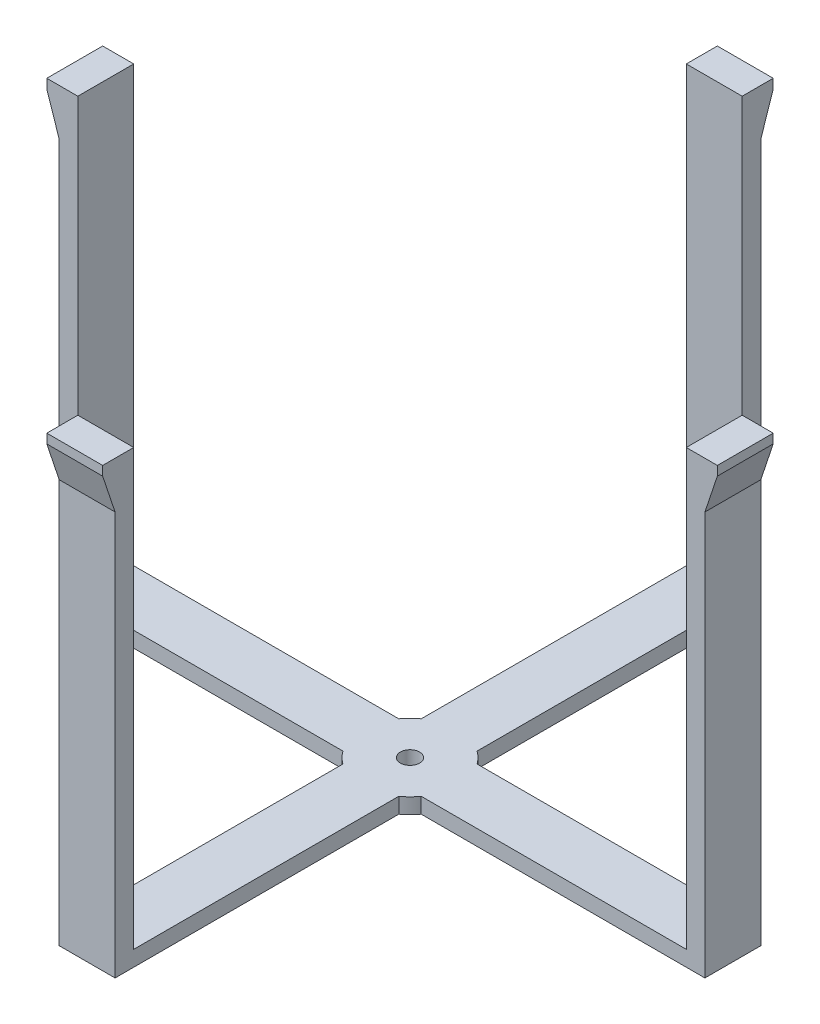
ISO-10303-21;
HEADER;
FILE_DESCRIPTION(('STEP AP214'),'2;1');
FILE_NAME('part.step','',(''),(''),'','','');
FILE_SCHEMA(('AUTOMOTIVE_DESIGN { 1 0 10303 214 1 1 1 1 }'));
ENDSEC;
DATA;
#1=APPLICATION_CONTEXT('core data for automotive mechanical design processes');
#2=APPLICATION_PROTOCOL_DEFINITION('international standard','automotive_design',2000,#1);
#3=PRODUCT_CONTEXT('',#1,'mechanical');
#4=PRODUCT('Part','Part','',(#3));
#5=PRODUCT_RELATED_PRODUCT_CATEGORY('part','',(#4));
#6=PRODUCT_DEFINITION_FORMATION('','',#4);
#7=PRODUCT_DEFINITION_CONTEXT('part definition',#1,'design');
#8=PRODUCT_DEFINITION('design','',#6,#7);
#9=PRODUCT_DEFINITION_SHAPE('','',#8);
#10=(LENGTH_UNIT() NAMED_UNIT(*) SI_UNIT(.MILLI.,.METRE.));
#11=(NAMED_UNIT(*) PLANE_ANGLE_UNIT() SI_UNIT($,.RADIAN.));
#12=(NAMED_UNIT(*) SI_UNIT($,.STERADIAN.) SOLID_ANGLE_UNIT());
#13=UNCERTAINTY_MEASURE_WITH_UNIT(LENGTH_MEASURE(1.E-05),#10,'distance_accuracy_value','');
#14=(GEOMETRIC_REPRESENTATION_CONTEXT(3) GLOBAL_UNCERTAINTY_ASSIGNED_CONTEXT((#13)) GLOBAL_UNIT_ASSIGNED_CONTEXT((#10,
#11,#12)) REPRESENTATION_CONTEXT('',''));
#15=CARTESIAN_POINT('',(0.,0.,0.));
#16=DIRECTION('',(0.,0.,1.));
#17=DIRECTION('',(1.,0.,0.));
#18=AXIS2_PLACEMENT_3D('',#15,#16,#17);
#19=CARTESIAN_POINT('',(11.4299999999999,6.35,-132.08));
#20=DIRECTION('',(0.,0.,1.));
#21=DIRECTION('',(1.,0.,0.));
#22=AXIS2_PLACEMENT_3D('',#19,#20,#21);
#23=PLANE('',#22);
#24=DIRECTION('',(-1.,0.,0.));
#25=VECTOR('',#24,1.);
#26=CARTESIAN_POINT('',(11.4299999999987,165.1,-132.08));
#27=LINE('',#26,#25);
#28=CARTESIAN_POINT('',(11.4299999999999,165.1,-132.08));
#29=VERTEX_POINT('',#28);
#30=CARTESIAN_POINT('',(-11.4300000000013,165.1,-132.08));
#31=VERTEX_POINT('',#30);
#32=EDGE_CURVE('E54',#29,#31,#27,.T.);
#33=ORIENTED_EDGE('',*,*,#32,.F.);
#34=DIRECTION('',(0.,-1.,0.));
#35=VECTOR('',#34,1.);
#36=CARTESIAN_POINT('',(11.4299999999999,6.35,-132.08));
#37=LINE('',#36,#35);
#38=CARTESIAN_POINT('',(11.4299999999999,0.,-132.08));
#39=VERTEX_POINT('',#38);
#40=EDGE_CURVE('E488',#29,#39,#37,.T.);
#41=ORIENTED_EDGE('',*,*,#40,.T.);
#42=DIRECTION('',(-1.,0.,0.));
#43=VECTOR('',#42,1.);
#44=CARTESIAN_POINT('',(11.4299999999999,0.,-132.08));
#45=LINE('',#44,#43);
#46=CARTESIAN_POINT('',(-11.43,0.,-132.08));
#47=VERTEX_POINT('',#46);
#48=EDGE_CURVE('E440',#39,#47,#45,.T.);
#49=ORIENTED_EDGE('',*,*,#48,.T.);
#50=DIRECTION('',(0.,-1.,0.));
#51=VECTOR('',#50,1.);
#52=CARTESIAN_POINT('',(-11.43,6.35,-132.08));
#53=LINE('',#52,#51);
#54=EDGE_CURVE('E486',#31,#47,#53,.T.);
#55=ORIENTED_EDGE('',*,*,#54,.F.);
#56=EDGE_LOOP('',(#33,#41,#49,#55));
#57=FACE_BOUND('',#56,.T.);
#58=ADVANCED_FACE('F38',(#57),#23,.F.);
#59=CARTESIAN_POINT('',(132.08,6.35,11.4299999999999));
#60=DIRECTION('',(-1.,0.,0.));
#61=DIRECTION('',(0.,0.,1.));
#62=AXIS2_PLACEMENT_3D('',#59,#60,#61);
#63=PLANE('',#62);
#64=DIRECTION('',(0.,0.,-1.));
#65=VECTOR('',#64,1.);
#66=CARTESIAN_POINT('',(132.08,165.1,11.4300000000001));
#67=LINE('',#66,#65);
#68=CARTESIAN_POINT('',(132.08,165.1,11.4299999999999));
#69=VERTEX_POINT('',#68);
#70=CARTESIAN_POINT('',(132.08,165.1,-11.4299999999999));
#71=VERTEX_POINT('',#70);
#72=EDGE_CURVE('E62',#69,#71,#67,.T.);
#73=ORIENTED_EDGE('',*,*,#72,.F.);
#74=DIRECTION('',(0.,-1.,0.));
#75=VECTOR('',#74,1.);
#76=CARTESIAN_POINT('',(132.08,6.35,11.4299999999999));
#77=LINE('',#76,#75);
#78=CARTESIAN_POINT('',(132.08,0.,11.4299999999999));
#79=VERTEX_POINT('',#78);
#80=EDGE_CURVE('E47',#69,#79,#77,.T.);
#81=ORIENTED_EDGE('',*,*,#80,.T.);
#82=DIRECTION('',(0.,0.,-1.));
#83=VECTOR('',#82,1.);
#84=CARTESIAN_POINT('',(132.08,0.,11.4299999999999));
#85=LINE('',#84,#83);
#86=CARTESIAN_POINT('',(132.08,0.,-11.43));
#87=VERTEX_POINT('',#86);
#88=EDGE_CURVE('E431',#79,#87,#85,.T.);
#89=ORIENTED_EDGE('',*,*,#88,.T.);
#90=DIRECTION('',(0.,-1.,0.));
#91=VECTOR('',#90,1.);
#92=CARTESIAN_POINT('',(132.08,6.35,-11.43));
#93=LINE('',#92,#91);
#94=EDGE_CURVE('E496',#71,#87,#93,.T.);
#95=ORIENTED_EDGE('',*,*,#94,.F.);
#96=EDGE_LOOP('',(#73,#81,#89,#95));
#97=FACE_BOUND('',#96,.T.);
#98=ADVANCED_FACE('F498',(#97),#63,.F.);
#99=CARTESIAN_POINT('',(-11.4299999999999,6.35,132.08));
#100=DIRECTION('',(0.,0.,-1.));
#101=DIRECTION('',(-1.,0.,0.));
#102=AXIS2_PLACEMENT_3D('',#99,#100,#101);
#103=PLANE('',#102);
#104=DIRECTION('',(1.,0.,0.));
#105=VECTOR('',#104,1.);
#106=CARTESIAN_POINT('',(-11.4299999999996,165.1,132.08));
#107=LINE('',#106,#105);
#108=CARTESIAN_POINT('',(-11.4299999999999,165.1,132.08));
#109=VERTEX_POINT('',#108);
#110=CARTESIAN_POINT('',(11.4300000000004,165.1,132.08));
#111=VERTEX_POINT('',#110);
#112=EDGE_CURVE('E315',#109,#111,#107,.T.);
#113=ORIENTED_EDGE('',*,*,#112,.F.);
#114=DIRECTION('',(0.,-1.,0.));
#115=VECTOR('',#114,1.);
#116=CARTESIAN_POINT('',(-11.4299999999999,6.35,132.08));
#117=LINE('',#116,#115);
#118=CARTESIAN_POINT('',(-11.4299999999999,0.,132.08));
#119=VERTEX_POINT('',#118);
#120=EDGE_CURVE('E468',#109,#119,#117,.T.);
#121=ORIENTED_EDGE('',*,*,#120,.T.);
#122=DIRECTION('',(1.,0.,0.));
#123=VECTOR('',#122,1.);
#124=CARTESIAN_POINT('',(-11.4299999999999,0.,132.08));
#125=LINE('',#124,#123);
#126=CARTESIAN_POINT('',(11.43,0.,132.08));
#127=VERTEX_POINT('',#126);
#128=EDGE_CURVE('E460',#119,#127,#125,.T.);
#129=ORIENTED_EDGE('',*,*,#128,.T.);
#130=DIRECTION('',(0.,-1.,0.));
#131=VECTOR('',#130,1.);
#132=CARTESIAN_POINT('',(11.43,6.35,132.08));
#133=LINE('',#132,#131);
#134=EDGE_CURVE('E466',#111,#127,#133,.T.);
#135=ORIENTED_EDGE('',*,*,#134,.F.);
#136=EDGE_LOOP('',(#113,#121,#129,#135));
#137=FACE_BOUND('',#136,.T.);
#138=ADVANCED_FACE('F549',(#137),#103,.F.);
#139=CARTESIAN_POINT('',(-132.08,6.35,-11.4299999999999));
#140=DIRECTION('',(1.,0.,0.));
#141=DIRECTION('',(0.,0.,-1.));
#142=AXIS2_PLACEMENT_3D('',#139,#140,#141);
#143=PLANE('',#142);
#144=DIRECTION('',(0.,0.,1.));
#145=VECTOR('',#144,1.);
#146=CARTESIAN_POINT('',(-132.08,165.1,-11.4300000000001));
#147=LINE('',#146,#145);
#148=CARTESIAN_POINT('',(-132.08,165.1,-11.4299999999999));
#149=VERTEX_POINT('',#148);
#150=CARTESIAN_POINT('',(-132.08,165.1,11.4299999999999));
#151=VERTEX_POINT('',#150);
#152=EDGE_CURVE('E335',#149,#151,#147,.T.);
#153=ORIENTED_EDGE('',*,*,#152,.F.);
#154=DIRECTION('',(0.,-1.,0.));
#155=VECTOR('',#154,1.);
#156=CARTESIAN_POINT('',(-132.08,6.35,-11.4299999999999));
#157=LINE('',#156,#155);
#158=CARTESIAN_POINT('',(-132.08,0.,-11.4299999999999));
#159=VERTEX_POINT('',#158);
#160=EDGE_CURVE('E478',#149,#159,#157,.T.);
#161=ORIENTED_EDGE('',*,*,#160,.T.);
#162=DIRECTION('',(0.,0.,1.));
#163=VECTOR('',#162,1.);
#164=CARTESIAN_POINT('',(-132.08,0.,-11.4299999999999));
#165=LINE('',#164,#163);
#166=CARTESIAN_POINT('',(-132.08,0.,11.43));
#167=VERTEX_POINT('',#166);
#168=EDGE_CURVE('E450',#159,#167,#165,.T.);
#169=ORIENTED_EDGE('',*,*,#168,.T.);
#170=DIRECTION('',(0.,-1.,0.));
#171=VECTOR('',#170,1.);
#172=CARTESIAN_POINT('',(-132.08,6.35,11.43));
#173=LINE('',#172,#171);
#174=EDGE_CURVE('E476',#151,#167,#173,.T.);
#175=ORIENTED_EDGE('',*,*,#174,.F.);
#176=EDGE_LOOP('',(#153,#161,#169,#175));
#177=FACE_BOUND('',#176,.T.);
#178=ADVANCED_FACE('F569',(#177),#143,.F.);
#179=CARTESIAN_POINT('',(0.,6.35,0.));
#180=DIRECTION('',(0.,1.,0.));
#181=DIRECTION('',(0.,0.,1.));
#182=AXIS2_PLACEMENT_3D('',#179,#180,#181);
#183=PLANE('',#182);
#184=CARTESIAN_POINT('',(0.,6.35,0.));
#185=DIRECTION('',(0.,1.,0.));
#186=DIRECTION('',(0.,0.,1.));
#187=AXIS2_PLACEMENT_3D('',#184,#185,#186);
#188=CIRCLE('',#187,3.937);
#189=CARTESIAN_POINT('',(0.,6.35,3.937));
#190=VERTEX_POINT('',#189);
#191=EDGE_CURVE('E394',#190,#190,#188,.T.);
#192=ORIENTED_EDGE('',*,*,#191,.F.);
#193=EDGE_LOOP('',(#192));
#194=FACE_BOUND('',#193,.T.);
#195=DIRECTION('',(1.,0.,0.));
#196=VECTOR('',#195,1.);
#197=CARTESIAN_POINT('',(16.0266754194375,6.35,11.4299999999999));
#198=LINE('',#197,#196);
#199=CARTESIAN_POINT('',(16.0266754194375,6.35,11.4299999999999));
#200=VERTEX_POINT('',#199);
#201=CARTESIAN_POINT('',(124.46,6.35,11.4299999999999));
#202=VERTEX_POINT('',#201);
#203=EDGE_CURVE('E400',#200,#202,#198,.T.);
#204=ORIENTED_EDGE('',*,*,#203,.T.);
#205=DIRECTION('',(0.,0.,1.));
#206=VECTOR('',#205,1.);
#207=CARTESIAN_POINT('',(124.46,6.35,-11.4299999999987));
#208=LINE('',#207,#206);
#209=CARTESIAN_POINT('',(124.46,6.35,-11.4299999999987));
#210=VERTEX_POINT('',#209);
#211=EDGE_CURVE('E338',#210,#202,#208,.T.);
#212=ORIENTED_EDGE('',*,*,#211,.F.);
#213=DIRECTION('',(-1.,0.,0.));
#214=VECTOR('',#213,1.);
#215=CARTESIAN_POINT('',(16.0266754194374,6.35,-11.4300000000001));
#216=LINE('',#215,#214);
#217=CARTESIAN_POINT('',(16.0266754194374,6.35,-11.4300000000001));
#218=VERTEX_POINT('',#217);
#219=EDGE_CURVE('E403',#210,#218,#216,.T.);
#220=ORIENTED_EDGE('',*,*,#219,.T.);
#221=CARTESIAN_POINT('',(0.,6.35,0.));
#222=DIRECTION('',(0.,1.,0.));
#223=DIRECTION('',(0.,0.,1.));
#224=AXIS2_PLACEMENT_3D('',#221,#222,#223);
#225=CIRCLE('',#224,19.685);
#226=CARTESIAN_POINT('',(11.4299999999999,6.35,-16.0266754194375));
#227=VERTEX_POINT('',#226);
#228=EDGE_CURVE('E405',#218,#227,#225,.T.);
#229=ORIENTED_EDGE('',*,*,#228,.T.);
#230=DIRECTION('',(0.,0.,-1.));
#231=VECTOR('',#230,1.);
#232=CARTESIAN_POINT('',(11.4299999999999,6.35,-16.0266754194375));
#233=LINE('',#232,#231);
#234=CARTESIAN_POINT('',(11.4299999999999,6.35,-124.46));
#235=VERTEX_POINT('',#234);
#236=EDGE_CURVE('E407',#227,#235,#233,.T.);
#237=ORIENTED_EDGE('',*,*,#236,.T.);
#238=DIRECTION('',(1.,0.,0.));
#239=VECTOR('',#238,1.);
#240=CARTESIAN_POINT('',(-11.43,6.35,-124.46));
#241=LINE('',#240,#239);
#242=CARTESIAN_POINT('',(-11.43,6.35,-124.46));
#243=VERTEX_POINT('',#242);
#244=EDGE_CURVE('E260',#243,#235,#241,.T.);
#245=ORIENTED_EDGE('',*,*,#244,.F.);
#246=DIRECTION('',(0.,0.,1.));
#247=VECTOR('',#246,1.);
#248=CARTESIAN_POINT('',(-11.4300000000001,6.35,-16.0266754194374));
#249=LINE('',#248,#247);
#250=CARTESIAN_POINT('',(-11.4300000000001,6.35,-16.0266754194374));
#251=VERTEX_POINT('',#250);
#252=EDGE_CURVE('E409',#243,#251,#249,.T.);
#253=ORIENTED_EDGE('',*,*,#252,.T.);
#254=CARTESIAN_POINT('',(0.,6.35,0.));
#255=DIRECTION('',(0.,1.,0.));
#256=DIRECTION('',(0.,0.,1.));
#257=AXIS2_PLACEMENT_3D('',#254,#255,#256);
#258=CIRCLE('',#257,19.685);
#259=CARTESIAN_POINT('',(-16.0266754194374,6.35,-11.4300000000001));
#260=VERTEX_POINT('',#259);
#261=EDGE_CURVE('E411',#251,#260,#258,.T.);
#262=ORIENTED_EDGE('',*,*,#261,.T.);
#263=DIRECTION('',(-1.,0.,0.));
#264=VECTOR('',#263,1.);
#265=CARTESIAN_POINT('',(-16.0266754194374,6.35,-11.4300000000001));
#266=LINE('',#265,#264);
#267=CARTESIAN_POINT('',(-124.46,6.35,-11.4300000000005));
#268=VERTEX_POINT('',#267);
#269=EDGE_CURVE('E413',#260,#268,#266,.T.);
#270=ORIENTED_EDGE('',*,*,#269,.T.);
#271=DIRECTION('',(0.,0.,-1.));
#272=VECTOR('',#271,1.);
#273=CARTESIAN_POINT('',(-124.46,6.35,11.4299999999996));
#274=LINE('',#273,#272);
#275=CARTESIAN_POINT('',(-124.46,6.35,11.43));
#276=VERTEX_POINT('',#275);
#277=EDGE_CURVE('E366',#276,#268,#274,.T.);
#278=ORIENTED_EDGE('',*,*,#277,.F.);
#279=DIRECTION('',(1.,0.,0.));
#280=VECTOR('',#279,1.);
#281=CARTESIAN_POINT('',(-16.0266754194375,6.35,11.4299999999999));
#282=LINE('',#281,#280);
#283=CARTESIAN_POINT('',(-16.0266754194375,6.35,11.4299999999999));
#284=VERTEX_POINT('',#283);
#285=EDGE_CURVE('E416',#276,#284,#282,.T.);
#286=ORIENTED_EDGE('',*,*,#285,.T.);
#287=CARTESIAN_POINT('',(0.,6.35,0.));
#288=DIRECTION('',(0.,1.,0.));
#289=DIRECTION('',(0.,0.,1.));
#290=AXIS2_PLACEMENT_3D('',#287,#288,#289);
#291=CIRCLE('',#290,19.685);
#292=CARTESIAN_POINT('',(-11.4300000000001,6.35,16.0266754194374));
#293=VERTEX_POINT('',#292);
#294=EDGE_CURVE('E418',#284,#293,#291,.T.);
#295=ORIENTED_EDGE('',*,*,#294,.T.);
#296=DIRECTION('',(0.,0.,1.));
#297=VECTOR('',#296,1.);
#298=CARTESIAN_POINT('',(-11.4300000000001,6.35,16.0266754194374));
#299=LINE('',#298,#297);
#300=CARTESIAN_POINT('',(-11.4300000000001,6.35,124.46));
#301=VERTEX_POINT('',#300);
#302=EDGE_CURVE('E420',#293,#301,#299,.T.);
#303=ORIENTED_EDGE('',*,*,#302,.T.);
#304=DIRECTION('',(-1.,0.,0.));
#305=VECTOR('',#304,1.);
#306=CARTESIAN_POINT('',(11.43,6.35,124.46));
#307=LINE('',#306,#305);
#308=CARTESIAN_POINT('',(11.43,6.35,124.46));
#309=VERTEX_POINT('',#308);
#310=EDGE_CURVE('E379',#309,#301,#307,.T.);
#311=ORIENTED_EDGE('',*,*,#310,.F.);
#312=DIRECTION('',(0.,0.,-1.));
#313=VECTOR('',#312,1.);
#314=CARTESIAN_POINT('',(11.4299999999999,6.35,16.0266754194375));
#315=LINE('',#314,#313);
#316=CARTESIAN_POINT('',(11.4299999999999,6.35,16.0266754194375));
#317=VERTEX_POINT('',#316);
#318=EDGE_CURVE('E422',#309,#317,#315,.T.);
#319=ORIENTED_EDGE('',*,*,#318,.T.);
#320=CARTESIAN_POINT('',(0.,6.35,0.));
#321=DIRECTION('',(0.,1.,0.));
#322=DIRECTION('',(0.,0.,1.));
#323=AXIS2_PLACEMENT_3D('',#320,#321,#322);
#324=CIRCLE('',#323,19.685);
#325=EDGE_CURVE('E397',#317,#200,#324,.T.);
#326=ORIENTED_EDGE('',*,*,#325,.T.);
#327=EDGE_LOOP('',(#204,#212,#220,#229,#237,#245,#253,#262,#270,#278,#286,#295,#303,#311,#319,#326));
#328=FACE_BOUND('',#327,.T.);
#329=ADVANCED_FACE('F519',(#194,#328),#183,.T.);
#330=CARTESIAN_POINT('',(0.,6.35,0.));
#331=DIRECTION('',(0.,-1.,0.));
#332=DIRECTION('',(0.,0.,-1.));
#333=AXIS2_PLACEMENT_3D('',#330,#331,#332);
#334=CYLINDRICAL_SURFACE('',#333,19.685);
#335=CARTESIAN_POINT('',(0.,0.,0.));
#336=DIRECTION('',(0.,1.,0.));
#337=DIRECTION('',(0.,0.,1.));
#338=AXIS2_PLACEMENT_3D('',#335,#336,#337);
#339=CIRCLE('',#338,19.685);
#340=CARTESIAN_POINT('',(11.4299999999999,0.,16.0266754194375));
#341=VERTEX_POINT('',#340);
#342=CARTESIAN_POINT('',(16.0266754194375,0.,11.4299999999999));
#343=VERTEX_POINT('',#342);
#344=EDGE_CURVE('E425',#341,#343,#339,.T.);
#345=ORIENTED_EDGE('',*,*,#344,.T.);
#346=DIRECTION('',(0.,-1.,0.));
#347=VECTOR('',#346,1.);
#348=CARTESIAN_POINT('',(16.0266754194375,6.35,11.4299999999999));
#349=LINE('',#348,#347);
#350=EDGE_CURVE('E11',#200,#343,#349,.T.);
#351=ORIENTED_EDGE('',*,*,#350,.F.);
#352=ORIENTED_EDGE('',*,*,#325,.F.);
#353=DIRECTION('',(0.,-1.,0.));
#354=VECTOR('',#353,1.);
#355=CARTESIAN_POINT('',(11.4299999999999,6.35,16.0266754194375));
#356=LINE('',#355,#354);
#357=EDGE_CURVE('E424',#317,#341,#356,.T.);
#358=ORIENTED_EDGE('',*,*,#357,.T.);
#359=EDGE_LOOP('',(#345,#351,#352,#358));
#360=FACE_BOUND('',#359,.T.);
#361=ADVANCED_FACE('F40',(#360),#334,.T.);
#362=CARTESIAN_POINT('',(16.0266754194375,6.35,11.4299999999999));
#363=DIRECTION('',(0.,0.,-1.));
#364=DIRECTION('',(-1.,0.,0.));
#365=AXIS2_PLACEMENT_3D('',#362,#363,#364);
#366=PLANE('',#365);
#367=DIRECTION('',(1.,0.,0.));
#368=VECTOR('',#367,1.);
#369=CARTESIAN_POINT('',(16.0266754194375,0.,11.4299999999999));
#370=LINE('',#369,#368);
#371=EDGE_CURVE('E428',#343,#79,#370,.T.);
#372=ORIENTED_EDGE('',*,*,#371,.T.);
#373=ORIENTED_EDGE('',*,*,#80,.F.);
#374=DIRECTION('',(-0.316227766016838,-0.948683298050514,0.));
#375=VECTOR('',#374,1.);
#376=CARTESIAN_POINT('',(137.16,180.34,11.4300000000001));
#377=LINE('',#376,#375);
#378=CARTESIAN_POINT('',(137.16,180.34,11.4300000000001));
#379=VERTEX_POINT('',#378);
#380=EDGE_CURVE('E288',#379,#69,#377,.T.);
#381=ORIENTED_EDGE('',*,*,#380,.F.);
#382=DIRECTION('',(0.,-1.,0.));
#383=VECTOR('',#382,1.);
#384=CARTESIAN_POINT('',(137.16,184.15,11.4300000000001));
#385=LINE('',#384,#383);
#386=CARTESIAN_POINT('',(137.16,184.15,11.4300000000001));
#387=VERTEX_POINT('',#386);
#388=EDGE_CURVE('E285',#387,#379,#385,.T.);
#389=ORIENTED_EDGE('',*,*,#388,.F.);
#390=DIRECTION('',(1.,0.,0.));
#391=VECTOR('',#390,1.);
#392=CARTESIAN_POINT('',(124.46,184.15,11.4300000000014));
#393=LINE('',#392,#391);
#394=CARTESIAN_POINT('',(124.46,184.15,11.4300000000014));
#395=VERTEX_POINT('',#394);
#396=EDGE_CURVE('E343',#395,#387,#393,.T.);
#397=ORIENTED_EDGE('',*,*,#396,.F.);
#398=DIRECTION('',(0.,-1.,0.));
#399=VECTOR('',#398,1.);
#400=CARTESIAN_POINT('',(124.46,184.15,11.4300000000014));
#401=LINE('',#400,#399);
#402=EDGE_CURVE('E349',#395,#202,#401,.T.);
#403=ORIENTED_EDGE('',*,*,#402,.T.);
#404=ORIENTED_EDGE('',*,*,#203,.F.);
#405=ORIENTED_EDGE('',*,*,#350,.T.);
#406=EDGE_LOOP('',(#372,#373,#381,#389,#397,#403,#404,#405));
#407=FACE_BOUND('',#406,.T.);
#408=ADVANCED_FACE('F503',(#407),#366,.F.);
#409=CARTESIAN_POINT('',(16.0266754194374,6.35,-11.4300000000001));
#410=DIRECTION('',(0.,0.,1.));
#411=DIRECTION('',(1.,0.,0.));
#412=AXIS2_PLACEMENT_3D('',#409,#410,#411);
#413=PLANE('',#412);
#414=DIRECTION('',(-1.,0.,0.));
#415=VECTOR('',#414,1.);
#416=CARTESIAN_POINT('',(16.0266754194374,0.,-11.4300000000001));
#417=LINE('',#416,#415);
#418=CARTESIAN_POINT('',(16.0266754194374,0.,-11.4300000000001));
#419=VERTEX_POINT('',#418);
#420=EDGE_CURVE('E434',#87,#419,#417,.T.);
#421=ORIENTED_EDGE('',*,*,#420,.T.);
#422=DIRECTION('',(0.,-1.,0.));
#423=VECTOR('',#422,1.);
#424=CARTESIAN_POINT('',(16.0266754194374,6.35,-11.4300000000001));
#425=LINE('',#424,#423);
#426=EDGE_CURVE('E493',#218,#419,#425,.T.);
#427=ORIENTED_EDGE('',*,*,#426,.F.);
#428=ORIENTED_EDGE('',*,*,#219,.F.);
#429=DIRECTION('',(0.,-1.,0.));
#430=VECTOR('',#429,1.);
#431=CARTESIAN_POINT('',(124.46,184.15,-11.4299999999987));
#432=LINE('',#431,#430);
#433=CARTESIAN_POINT('',(124.46,184.15,-11.4299999999987));
#434=VERTEX_POINT('',#433);
#435=EDGE_CURVE('E354',#434,#210,#432,.T.);
#436=ORIENTED_EDGE('',*,*,#435,.F.);
#437=DIRECTION('',(-1.,0.,0.));
#438=VECTOR('',#437,1.);
#439=CARTESIAN_POINT('',(132.08,184.15,-11.4299999999986));
#440=LINE('',#439,#438);
#441=CARTESIAN_POINT('',(137.16,184.15,-11.4299999999999));
#442=VERTEX_POINT('',#441);
#443=EDGE_CURVE('E345',#442,#434,#440,.T.);
#444=ORIENTED_EDGE('',*,*,#443,.F.);
#445=DIRECTION('',(0.,-1.,0.));
#446=VECTOR('',#445,1.);
#447=CARTESIAN_POINT('',(137.16,184.15,-11.4299999999999));
#448=LINE('',#447,#446);
#449=CARTESIAN_POINT('',(137.16,180.34,-11.4299999999999));
#450=VERTEX_POINT('',#449);
#451=EDGE_CURVE('E283',#442,#450,#448,.T.);
#452=ORIENTED_EDGE('',*,*,#451,.T.);
#453=DIRECTION('',(-0.316227766016838,-0.948683298050514,0.));
#454=VECTOR('',#453,1.);
#455=CARTESIAN_POINT('',(137.16,180.34,-11.4299999999999));
#456=LINE('',#455,#454);
#457=EDGE_CURVE('E289',#450,#71,#456,.T.);
#458=ORIENTED_EDGE('',*,*,#457,.T.);
#459=ORIENTED_EDGE('',*,*,#94,.T.);
#460=EDGE_LOOP('',(#421,#427,#428,#436,#444,#452,#458,#459));
#461=FACE_BOUND('',#460,.T.);
#462=ADVANCED_FACE('F512',(#461),#413,.F.);
#463=CARTESIAN_POINT('',(0.,6.35,0.));
#464=DIRECTION('',(0.,-1.,0.));
#465=DIRECTION('',(0.,0.,-1.));
#466=AXIS2_PLACEMENT_3D('',#463,#464,#465);
#467=CYLINDRICAL_SURFACE('',#466,19.685);
#468=CARTESIAN_POINT('',(0.,0.,0.));
#469=DIRECTION('',(0.,1.,0.));
#470=DIRECTION('',(0.,0.,1.));
#471=AXIS2_PLACEMENT_3D('',#468,#469,#470);
#472=CIRCLE('',#471,19.685);
#473=CARTESIAN_POINT('',(11.4299999999999,0.,-16.0266754194375));
#474=VERTEX_POINT('',#473);
#475=EDGE_CURVE('E436',#419,#474,#472,.T.);
#476=ORIENTED_EDGE('',*,*,#475,.T.);
#477=DIRECTION('',(0.,-1.,0.));
#478=VECTOR('',#477,1.);
#479=CARTESIAN_POINT('',(11.4299999999999,6.35,-16.0266754194375));
#480=LINE('',#479,#478);
#481=EDGE_CURVE('E490',#227,#474,#480,.T.);
#482=ORIENTED_EDGE('',*,*,#481,.F.);
#483=ORIENTED_EDGE('',*,*,#228,.F.);
#484=ORIENTED_EDGE('',*,*,#426,.T.);
#485=EDGE_LOOP('',(#476,#482,#483,#484));
#486=FACE_BOUND('',#485,.T.);
#487=ADVANCED_FACE('F515',(#486),#467,.T.);
#488=CARTESIAN_POINT('',(11.4299999999999,6.35,-16.0266754194375));
#489=DIRECTION('',(-1.,0.,0.));
#490=DIRECTION('',(0.,0.,1.));
#491=AXIS2_PLACEMENT_3D('',#488,#489,#490);
#492=PLANE('',#491);
#493=DIRECTION('',(0.,0.,-1.));
#494=VECTOR('',#493,1.);
#495=CARTESIAN_POINT('',(11.4299999999999,0.,-16.0266754194375));
#496=LINE('',#495,#494);
#497=EDGE_CURVE('E438',#474,#39,#496,.T.);
#498=ORIENTED_EDGE('',*,*,#497,.T.);
#499=ORIENTED_EDGE('',*,*,#40,.F.);
#500=DIRECTION('',(0.,-0.948683298050514,0.316227766016838));
#501=VECTOR('',#500,1.);
#502=CARTESIAN_POINT('',(11.4299999999986,180.34,-137.16));
#503=LINE('',#502,#501);
#504=CARTESIAN_POINT('',(11.4299999999986,180.34,-137.16));
#505=VERTEX_POINT('',#504);
#506=EDGE_CURVE('E270',#505,#29,#503,.T.);
#507=ORIENTED_EDGE('',*,*,#506,.F.);
#508=DIRECTION('',(0.,-1.,0.));
#509=VECTOR('',#508,1.);
#510=CARTESIAN_POINT('',(11.4299999999986,184.15,-137.16));
#511=LINE('',#510,#509);
#512=CARTESIAN_POINT('',(11.4299999999986,184.15,-137.16));
#513=VERTEX_POINT('',#512);
#514=EDGE_CURVE('E265',#513,#505,#511,.T.);
#515=ORIENTED_EDGE('',*,*,#514,.F.);
#516=DIRECTION('',(0.,0.,-1.));
#517=VECTOR('',#516,1.);
#518=CARTESIAN_POINT('',(11.4300000000001,184.15,-124.46));
#519=LINE('',#518,#517);
#520=CARTESIAN_POINT('',(11.4300000000001,184.15,-124.46));
#521=VERTEX_POINT('',#520);
#522=EDGE_CURVE('E248',#521,#513,#519,.T.);
#523=ORIENTED_EDGE('',*,*,#522,.F.);
#524=DIRECTION('',(0.,-1.,0.));
#525=VECTOR('',#524,1.);
#526=CARTESIAN_POINT('',(11.4300000000001,184.15,-124.46));
#527=LINE('',#526,#525);
#528=EDGE_CURVE('E359',#521,#235,#527,.T.);
#529=ORIENTED_EDGE('',*,*,#528,.T.);
#530=ORIENTED_EDGE('',*,*,#236,.F.);
#531=ORIENTED_EDGE('',*,*,#481,.T.);
#532=EDGE_LOOP('',(#498,#499,#507,#515,#523,#529,#530,#531));
#533=FACE_BOUND('',#532,.T.);
#534=ADVANCED_FACE('F273',(#533),#492,.F.);
#535=CARTESIAN_POINT('',(-11.4300000000001,6.35,-16.0266754194374));
#536=DIRECTION('',(1.,0.,0.));
#537=DIRECTION('',(0.,0.,-1.));
#538=AXIS2_PLACEMENT_3D('',#535,#536,#537);
#539=PLANE('',#538);
#540=DIRECTION('',(0.,0.,1.));
#541=VECTOR('',#540,1.);
#542=CARTESIAN_POINT('',(-11.4300000000001,0.,-16.0266754194374));
#543=LINE('',#542,#541);
#544=CARTESIAN_POINT('',(-11.4300000000001,0.,-16.0266754194374));
#545=VERTEX_POINT('',#544);
#546=EDGE_CURVE('E443',#47,#545,#543,.T.);
#547=ORIENTED_EDGE('',*,*,#546,.T.);
#548=DIRECTION('',(0.,-1.,0.));
#549=VECTOR('',#548,1.);
#550=CARTESIAN_POINT('',(-11.4300000000001,6.35,-16.0266754194374));
#551=LINE('',#550,#549);
#552=EDGE_CURVE('E483',#251,#545,#551,.T.);
#553=ORIENTED_EDGE('',*,*,#552,.F.);
#554=ORIENTED_EDGE('',*,*,#252,.F.);
#555=DIRECTION('',(0.,-1.,0.));
#556=VECTOR('',#555,1.);
#557=CARTESIAN_POINT('',(-11.43,184.15,-124.46));
#558=LINE('',#557,#556);
#559=CARTESIAN_POINT('',(-11.43,184.15,-124.46));
#560=VERTEX_POINT('',#559);
#561=EDGE_CURVE('E363',#560,#243,#558,.T.);
#562=ORIENTED_EDGE('',*,*,#561,.F.);
#563=DIRECTION('',(0.,0.,1.));
#564=VECTOR('',#563,1.);
#565=CARTESIAN_POINT('',(-11.43,184.15,-132.08));
#566=LINE('',#565,#564);
#567=CARTESIAN_POINT('',(-11.4300000000014,184.15,-137.16));
#568=VERTEX_POINT('',#567);
#569=EDGE_CURVE('E259',#568,#560,#566,.T.);
#570=ORIENTED_EDGE('',*,*,#569,.F.);
#571=DIRECTION('',(0.,-1.,0.));
#572=VECTOR('',#571,1.);
#573=CARTESIAN_POINT('',(-11.4300000000014,184.15,-137.16));
#574=LINE('',#573,#572);
#575=CARTESIAN_POINT('',(-11.4300000000014,180.34,-137.16));
#576=VERTEX_POINT('',#575);
#577=EDGE_CURVE('E268',#568,#576,#574,.T.);
#578=ORIENTED_EDGE('',*,*,#577,.T.);
#579=DIRECTION('',(0.,-0.948683298050514,0.316227766016838));
#580=VECTOR('',#579,1.);
#581=CARTESIAN_POINT('',(-11.4300000000014,180.34,-137.16));
#582=LINE('',#581,#580);
#583=EDGE_CURVE('E275',#576,#31,#582,.T.);
#584=ORIENTED_EDGE('',*,*,#583,.T.);
#585=ORIENTED_EDGE('',*,*,#54,.T.);
#586=EDGE_LOOP('',(#547,#553,#554,#562,#570,#578,#584,#585));
#587=FACE_BOUND('',#586,.T.);
#588=ADVANCED_FACE('F584',(#587),#539,.F.);
#589=CARTESIAN_POINT('',(0.,6.35,0.));
#590=DIRECTION('',(0.,-1.,0.));
#591=DIRECTION('',(0.,0.,-1.));
#592=AXIS2_PLACEMENT_3D('',#589,#590,#591);
#593=CYLINDRICAL_SURFACE('',#592,19.685);
#594=CARTESIAN_POINT('',(0.,0.,0.));
#595=DIRECTION('',(0.,1.,0.));
#596=DIRECTION('',(0.,0.,1.));
#597=AXIS2_PLACEMENT_3D('',#594,#595,#596);
#598=CIRCLE('',#597,19.685);
#599=CARTESIAN_POINT('',(-16.0266754194374,0.,-11.4300000000001));
#600=VERTEX_POINT('',#599);
#601=EDGE_CURVE('E445',#545,#600,#598,.T.);
#602=ORIENTED_EDGE('',*,*,#601,.T.);
#603=DIRECTION('',(0.,-1.,0.));
#604=VECTOR('',#603,1.);
#605=CARTESIAN_POINT('',(-16.0266754194374,6.35,-11.4300000000001));
#606=LINE('',#605,#604);
#607=EDGE_CURVE('E480',#260,#600,#606,.T.);
#608=ORIENTED_EDGE('',*,*,#607,.F.);
#609=ORIENTED_EDGE('',*,*,#261,.F.);
#610=ORIENTED_EDGE('',*,*,#552,.T.);
#611=EDGE_LOOP('',(#602,#608,#609,#610));
#612=FACE_BOUND('',#611,.T.);
#613=ADVANCED_FACE('F581',(#612),#593,.T.);
#614=CARTESIAN_POINT('',(-16.0266754194374,6.35,-11.4300000000001));
#615=DIRECTION('',(0.,0.,1.));
#616=DIRECTION('',(1.,0.,0.));
#617=AXIS2_PLACEMENT_3D('',#614,#615,#616);
#618=PLANE('',#617);
#619=DIRECTION('',(-1.,0.,0.));
#620=VECTOR('',#619,1.);
#621=CARTESIAN_POINT('',(-16.0266754194374,0.,-11.4300000000001));
#622=LINE('',#621,#620);
#623=EDGE_CURVE('E447',#600,#159,#622,.T.);
#624=ORIENTED_EDGE('',*,*,#623,.T.);
#625=ORIENTED_EDGE('',*,*,#160,.F.);
#626=DIRECTION('',(0.316227766016838,-0.948683298050514,0.));
#627=VECTOR('',#626,1.);
#628=CARTESIAN_POINT('',(-137.16,180.34,-11.4300000000001));
#629=LINE('',#628,#627);
#630=CARTESIAN_POINT('',(-137.16,180.34,-11.4300000000001));
#631=VERTEX_POINT('',#630);
#632=EDGE_CURVE('E326',#631,#149,#629,.T.);
#633=ORIENTED_EDGE('',*,*,#632,.F.);
#634=DIRECTION('',(0.,-1.,0.));
#635=VECTOR('',#634,1.);
#636=CARTESIAN_POINT('',(-137.16,184.15,-11.4300000000001));
#637=LINE('',#636,#635);
#638=CARTESIAN_POINT('',(-137.16,184.15,-11.4300000000001));
#639=VERTEX_POINT('',#638);
#640=EDGE_CURVE('E323',#639,#631,#637,.T.);
#641=ORIENTED_EDGE('',*,*,#640,.F.);
#642=DIRECTION('',(-1.,0.,0.));
#643=VECTOR('',#642,1.);
#644=CARTESIAN_POINT('',(-124.46,184.15,-11.4300000000005));
#645=LINE('',#644,#643);
#646=CARTESIAN_POINT('',(-124.46,184.15,-11.4300000000005));
#647=VERTEX_POINT('',#646);
#648=EDGE_CURVE('E367',#647,#639,#645,.T.);
#649=ORIENTED_EDGE('',*,*,#648,.F.);
#650=DIRECTION('',(0.,-1.,0.));
#651=VECTOR('',#650,1.);
#652=CARTESIAN_POINT('',(-124.46,184.15,-11.4300000000005));
#653=LINE('',#652,#651);
#654=EDGE_CURVE('E373',#647,#268,#653,.T.);
#655=ORIENTED_EDGE('',*,*,#654,.T.);
#656=ORIENTED_EDGE('',*,*,#269,.F.);
#657=ORIENTED_EDGE('',*,*,#607,.T.);
#658=EDGE_LOOP('',(#624,#625,#633,#641,#649,#655,#656,#657));
#659=FACE_BOUND('',#658,.T.);
#660=ADVANCED_FACE('F575',(#659),#618,.F.);
#661=CARTESIAN_POINT('',(-16.0266754194375,6.35,11.4299999999999));
#662=DIRECTION('',(0.,0.,-1.));
#663=DIRECTION('',(-1.,0.,0.));
#664=AXIS2_PLACEMENT_3D('',#661,#662,#663);
#665=PLANE('',#664);
#666=DIRECTION('',(1.,0.,0.));
#667=VECTOR('',#666,1.);
#668=CARTESIAN_POINT('',(-16.0266754194375,0.,11.4299999999999));
#669=LINE('',#668,#667);
#670=CARTESIAN_POINT('',(-16.0266754194375,0.,11.4299999999999));
#671=VERTEX_POINT('',#670);
#672=EDGE_CURVE('E453',#167,#671,#669,.T.);
#673=ORIENTED_EDGE('',*,*,#672,.T.);
#674=DIRECTION('',(0.,-1.,0.));
#675=VECTOR('',#674,1.);
#676=CARTESIAN_POINT('',(-16.0266754194375,6.35,11.4299999999999));
#677=LINE('',#676,#675);
#678=EDGE_CURVE('E473',#284,#671,#677,.T.);
#679=ORIENTED_EDGE('',*,*,#678,.F.);
#680=ORIENTED_EDGE('',*,*,#285,.F.);
#681=DIRECTION('',(0.,-1.,0.));
#682=VECTOR('',#681,1.);
#683=CARTESIAN_POINT('',(-124.46,184.15,11.4299999999996));
#684=LINE('',#683,#682);
#685=CARTESIAN_POINT('',(-124.46,184.15,11.4299999999996));
#686=VERTEX_POINT('',#685);
#687=EDGE_CURVE('E377',#686,#276,#684,.T.);
#688=ORIENTED_EDGE('',*,*,#687,.F.);
#689=DIRECTION('',(1.,0.,0.));
#690=VECTOR('',#689,1.);
#691=CARTESIAN_POINT('',(-132.08,184.15,11.4299999999996));
#692=LINE('',#691,#690);
#693=CARTESIAN_POINT('',(-137.16,184.15,11.4299999999999));
#694=VERTEX_POINT('',#693);
#695=EDGE_CURVE('E369',#694,#686,#692,.T.);
#696=ORIENTED_EDGE('',*,*,#695,.F.);
#697=DIRECTION('',(0.,-1.,0.));
#698=VECTOR('',#697,1.);
#699=CARTESIAN_POINT('',(-137.16,184.15,11.4299999999999));
#700=LINE('',#699,#698);
#701=CARTESIAN_POINT('',(-137.16,180.34,11.4299999999999));
#702=VERTEX_POINT('',#701);
#703=EDGE_CURVE('E318',#694,#702,#700,.T.);
#704=ORIENTED_EDGE('',*,*,#703,.T.);
#705=DIRECTION('',(0.316227766016838,-0.948683298050514,0.));
#706=VECTOR('',#705,1.);
#707=CARTESIAN_POINT('',(-137.16,180.34,11.4299999999999));
#708=LINE('',#707,#706);
#709=EDGE_CURVE('E327',#702,#151,#708,.T.);
#710=ORIENTED_EDGE('',*,*,#709,.T.);
#711=ORIENTED_EDGE('',*,*,#174,.T.);
#712=EDGE_LOOP('',(#673,#679,#680,#688,#696,#704,#710,#711));
#713=FACE_BOUND('',#712,.T.);
#714=ADVANCED_FACE('F565',(#713),#665,.F.);
#715=CARTESIAN_POINT('',(0.,6.35,0.));
#716=DIRECTION('',(0.,-1.,0.));
#717=DIRECTION('',(0.,0.,-1.));
#718=AXIS2_PLACEMENT_3D('',#715,#716,#717);
#719=CYLINDRICAL_SURFACE('',#718,19.685);
#720=CARTESIAN_POINT('',(0.,0.,0.));
#721=DIRECTION('',(0.,1.,0.));
#722=DIRECTION('',(0.,0.,1.));
#723=AXIS2_PLACEMENT_3D('',#720,#721,#722);
#724=CIRCLE('',#723,19.685);
#725=CARTESIAN_POINT('',(-11.4300000000001,0.,16.0266754194374));
#726=VERTEX_POINT('',#725);
#727=EDGE_CURVE('E455',#671,#726,#724,.T.);
#728=ORIENTED_EDGE('',*,*,#727,.T.);
#729=DIRECTION('',(0.,-1.,0.));
#730=VECTOR('',#729,1.);
#731=CARTESIAN_POINT('',(-11.4300000000001,6.35,16.0266754194374));
#732=LINE('',#731,#730);
#733=EDGE_CURVE('E470',#293,#726,#732,.T.);
#734=ORIENTED_EDGE('',*,*,#733,.F.);
#735=ORIENTED_EDGE('',*,*,#294,.F.);
#736=ORIENTED_EDGE('',*,*,#678,.T.);
#737=EDGE_LOOP('',(#728,#734,#735,#736));
#738=FACE_BOUND('',#737,.T.);
#739=ADVANCED_FACE('F560',(#738),#719,.T.);
#740=CARTESIAN_POINT('',(-11.4300000000001,6.35,16.0266754194374));
#741=DIRECTION('',(1.,0.,0.));
#742=DIRECTION('',(0.,0.,-1.));
#743=AXIS2_PLACEMENT_3D('',#740,#741,#742);
#744=PLANE('',#743);
#745=DIRECTION('',(0.,0.,1.));
#746=VECTOR('',#745,1.);
#747=CARTESIAN_POINT('',(-11.4300000000001,0.,16.0266754194374));
#748=LINE('',#747,#746);
#749=EDGE_CURVE('E457',#726,#119,#748,.T.);
#750=ORIENTED_EDGE('',*,*,#749,.T.);
#751=ORIENTED_EDGE('',*,*,#120,.F.);
#752=DIRECTION('',(0.,-0.948683298050514,-0.316227766016838));
#753=VECTOR('',#752,1.);
#754=CARTESIAN_POINT('',(-11.4299999999996,180.34,137.16));
#755=LINE('',#754,#753);
#756=CARTESIAN_POINT('',(-11.4299999999996,180.34,137.16));
#757=VERTEX_POINT('',#756);
#758=EDGE_CURVE('E306',#757,#109,#755,.T.);
#759=ORIENTED_EDGE('',*,*,#758,.F.);
#760=DIRECTION('',(0.,-1.,0.));
#761=VECTOR('',#760,1.);
#762=CARTESIAN_POINT('',(-11.4299999999996,184.15,137.16));
#763=LINE('',#762,#761);
#764=CARTESIAN_POINT('',(-11.4299999999996,184.15,137.16));
#765=VERTEX_POINT('',#764);
#766=EDGE_CURVE('E303',#765,#757,#763,.T.);
#767=ORIENTED_EDGE('',*,*,#766,.F.);
#768=DIRECTION('',(0.,0.,1.));
#769=VECTOR('',#768,1.);
#770=CARTESIAN_POINT('',(-11.4300000000001,184.15,124.46));
#771=LINE('',#770,#769);
#772=CARTESIAN_POINT('',(-11.4300000000001,184.15,124.46));
#773=VERTEX_POINT('',#772);
#774=EDGE_CURVE('E380',#773,#765,#771,.T.);
#775=ORIENTED_EDGE('',*,*,#774,.F.);
#776=DIRECTION('',(0.,-1.,0.));
#777=VECTOR('',#776,1.);
#778=CARTESIAN_POINT('',(-11.4300000000001,184.15,124.46));
#779=LINE('',#778,#777);
#780=EDGE_CURVE('E386',#773,#301,#779,.T.);
#781=ORIENTED_EDGE('',*,*,#780,.T.);
#782=ORIENTED_EDGE('',*,*,#302,.F.);
#783=ORIENTED_EDGE('',*,*,#733,.T.);
#784=EDGE_LOOP('',(#750,#751,#759,#767,#775,#781,#782,#783));
#785=FACE_BOUND('',#784,.T.);
#786=ADVANCED_FACE('F553',(#785),#744,.F.);
#787=CARTESIAN_POINT('',(11.4299999999999,6.35,16.0266754194375));
#788=DIRECTION('',(-1.,0.,0.));
#789=DIRECTION('',(0.,0.,1.));
#790=AXIS2_PLACEMENT_3D('',#787,#788,#789);
#791=PLANE('',#790);
#792=DIRECTION('',(0.,0.,-1.));
#793=VECTOR('',#792,1.);
#794=CARTESIAN_POINT('',(11.4299999999999,0.,16.0266754194375));
#795=LINE('',#794,#793);
#796=EDGE_CURVE('E401',#127,#341,#795,.T.);
#797=ORIENTED_EDGE('',*,*,#796,.T.);
#798=ORIENTED_EDGE('',*,*,#357,.F.);
#799=ORIENTED_EDGE('',*,*,#318,.F.);
#800=DIRECTION('',(0.,-1.,0.));
#801=VECTOR('',#800,1.);
#802=CARTESIAN_POINT('',(11.43,184.15,124.46));
#803=LINE('',#802,#801);
#804=CARTESIAN_POINT('',(11.43,184.15,124.46));
#805=VERTEX_POINT('',#804);
#806=EDGE_CURVE('E391',#805,#309,#803,.T.);
#807=ORIENTED_EDGE('',*,*,#806,.F.);
#808=DIRECTION('',(0.,0.,-1.));
#809=VECTOR('',#808,1.);
#810=CARTESIAN_POINT('',(11.43,184.15,132.08));
#811=LINE('',#810,#809);
#812=CARTESIAN_POINT('',(11.4300000000004,184.15,137.16));
#813=VERTEX_POINT('',#812);
#814=EDGE_CURVE('E382',#813,#805,#811,.T.);
#815=ORIENTED_EDGE('',*,*,#814,.F.);
#816=DIRECTION('',(0.,-1.,0.));
#817=VECTOR('',#816,1.);
#818=CARTESIAN_POINT('',(11.4300000000004,184.15,137.16));
#819=LINE('',#818,#817);
#820=CARTESIAN_POINT('',(11.4300000000004,180.34,137.16));
#821=VERTEX_POINT('',#820);
#822=EDGE_CURVE('E298',#813,#821,#819,.T.);
#823=ORIENTED_EDGE('',*,*,#822,.T.);
#824=DIRECTION('',(0.,-0.948683298050514,-0.316227766016838));
#825=VECTOR('',#824,1.);
#826=CARTESIAN_POINT('',(11.4300000000004,180.34,137.16));
#827=LINE('',#826,#825);
#828=EDGE_CURVE('E307',#821,#111,#827,.T.);
#829=ORIENTED_EDGE('',*,*,#828,.T.);
#830=ORIENTED_EDGE('',*,*,#134,.T.);
#831=EDGE_LOOP('',(#797,#798,#799,#807,#815,#823,#829,#830));
#832=FACE_BOUND('',#831,.T.);
#833=ADVANCED_FACE('F546',(#832),#791,.F.);
#834=CARTESIAN_POINT('',(0.,0.,0.));
#835=DIRECTION('',(0.,1.,0.));
#836=DIRECTION('',(0.,0.,1.));
#837=AXIS2_PLACEMENT_3D('',#834,#835,#836);
#838=PLANE('',#837);
#839=CARTESIAN_POINT('',(0.,0.,0.));
#840=DIRECTION('',(0.,1.,0.));
#841=DIRECTION('',(0.,0.,1.));
#842=AXIS2_PLACEMENT_3D('',#839,#840,#841);
#843=CIRCLE('',#842,3.937);
#844=CARTESIAN_POINT('',(0.,0.,3.937));
#845=VERTEX_POINT('',#844);
#846=EDGE_CURVE('E42',#845,#845,#843,.T.);
#847=ORIENTED_EDGE('',*,*,#846,.T.);
#848=EDGE_LOOP('',(#847));
#849=FACE_BOUND('',#848,.T.);
#850=ORIENTED_EDGE('',*,*,#344,.F.);
#851=ORIENTED_EDGE('',*,*,#796,.F.);
#852=ORIENTED_EDGE('',*,*,#128,.F.);
#853=ORIENTED_EDGE('',*,*,#749,.F.);
#854=ORIENTED_EDGE('',*,*,#727,.F.);
#855=ORIENTED_EDGE('',*,*,#672,.F.);
#856=ORIENTED_EDGE('',*,*,#168,.F.);
#857=ORIENTED_EDGE('',*,*,#623,.F.);
#858=ORIENTED_EDGE('',*,*,#601,.F.);
#859=ORIENTED_EDGE('',*,*,#546,.F.);
#860=ORIENTED_EDGE('',*,*,#48,.F.);
#861=ORIENTED_EDGE('',*,*,#497,.F.);
#862=ORIENTED_EDGE('',*,*,#475,.F.);
#863=ORIENTED_EDGE('',*,*,#420,.F.);
#864=ORIENTED_EDGE('',*,*,#88,.F.);
#865=ORIENTED_EDGE('',*,*,#371,.F.);
#866=EDGE_LOOP('',(#850,#851,#852,#853,#854,#855,#856,#857,#858,#859,#860,#861,#862,#863,#864,#865));
#867=FACE_BOUND('',#866,.T.);
#868=ADVANCED_FACE('F507',(#849,#867),#838,.F.);
#869=CARTESIAN_POINT('',(0.,-120.65,0.));
#870=DIRECTION('',(0.,1.,0.));
#871=DIRECTION('',(0.,0.,1.));
#872=AXIS2_PLACEMENT_3D('',#869,#870,#871);
#873=CYLINDRICAL_SURFACE('',#872,3.937);
#874=ORIENTED_EDGE('',*,*,#191,.T.);
#875=EDGE_LOOP('',(#874));
#876=FACE_BOUND('',#875,.T.);
#877=ORIENTED_EDGE('',*,*,#846,.F.);
#878=EDGE_LOOP('',(#877));
#879=FACE_BOUND('',#878,.T.);
#880=ADVANCED_FACE('F644',(#876,#879),#873,.F.);
#881=CARTESIAN_POINT('',(11.43,184.15,124.46));
#882=DIRECTION('',(0.,0.,1.));
#883=DIRECTION('',(1.,0.,0.));
#884=AXIS2_PLACEMENT_3D('',#881,#882,#883);
#885=PLANE('',#884);
#886=ORIENTED_EDGE('',*,*,#310,.T.);
#887=ORIENTED_EDGE('',*,*,#780,.F.);
#888=DIRECTION('',(-1.,0.,0.));
#889=VECTOR('',#888,1.);
#890=CARTESIAN_POINT('',(11.43,184.15,124.46));
#891=LINE('',#890,#889);
#892=EDGE_CURVE('E384',#805,#773,#891,.T.);
#893=ORIENTED_EDGE('',*,*,#892,.F.);
#894=ORIENTED_EDGE('',*,*,#806,.T.);
#895=EDGE_LOOP('',(#886,#887,#893,#894));
#896=FACE_BOUND('',#895,.T.);
#897=ADVANCED_FACE('F784',(#896),#885,.F.);
#898=CARTESIAN_POINT('',(0.,184.15,0.));
#899=DIRECTION('',(0.,1.,0.));
#900=DIRECTION('',(0.,0.,1.));
#901=AXIS2_PLACEMENT_3D('',#898,#899,#900);
#902=PLANE('',#901);
#903=ORIENTED_EDGE('',*,*,#774,.T.);
#904=DIRECTION('',(1.,0.,0.));
#905=VECTOR('',#904,1.);
#906=CARTESIAN_POINT('',(-11.4299999999996,184.15,137.16));
#907=LINE('',#906,#905);
#908=EDGE_CURVE('E310',#765,#813,#907,.T.);
#909=ORIENTED_EDGE('',*,*,#908,.T.);
#910=ORIENTED_EDGE('',*,*,#814,.T.);
#911=ORIENTED_EDGE('',*,*,#892,.T.);
#912=EDGE_LOOP('',(#903,#909,#910,#911));
#913=FACE_BOUND('',#912,.T.);
#914=ADVANCED_FACE('F772',(#913),#902,.T.);
#915=CARTESIAN_POINT('',(-124.46,184.15,11.4299999999996));
#916=DIRECTION('',(-1.,0.,0.));
#917=DIRECTION('',(0.,0.,1.));
#918=AXIS2_PLACEMENT_3D('',#915,#916,#917);
#919=PLANE('',#918);
#920=ORIENTED_EDGE('',*,*,#277,.T.);
#921=ORIENTED_EDGE('',*,*,#654,.F.);
#922=DIRECTION('',(0.,0.,-1.));
#923=VECTOR('',#922,1.);
#924=CARTESIAN_POINT('',(-124.46,184.15,11.4299999999996));
#925=LINE('',#924,#923);
#926=EDGE_CURVE('E371',#686,#647,#925,.T.);
#927=ORIENTED_EDGE('',*,*,#926,.F.);
#928=ORIENTED_EDGE('',*,*,#687,.T.);
#929=EDGE_LOOP('',(#920,#921,#927,#928));
#930=FACE_BOUND('',#929,.T.);
#931=ADVANCED_FACE('F592',(#930),#919,.F.);
#932=CARTESIAN_POINT('',(0.,184.15,0.));
#933=DIRECTION('',(0.,1.,0.));
#934=DIRECTION('',(-1.,0.,0.));
#935=AXIS2_PLACEMENT_3D('',#932,#933,#934);
#936=PLANE('',#935);
#937=ORIENTED_EDGE('',*,*,#648,.T.);
#938=DIRECTION('',(0.,0.,1.));
#939=VECTOR('',#938,1.);
#940=CARTESIAN_POINT('',(-137.16,184.15,-11.4300000000001));
#941=LINE('',#940,#939);
#942=EDGE_CURVE('E330',#639,#694,#941,.T.);
#943=ORIENTED_EDGE('',*,*,#942,.T.);
#944=ORIENTED_EDGE('',*,*,#695,.T.);
#945=ORIENTED_EDGE('',*,*,#926,.T.);
#946=EDGE_LOOP('',(#937,#943,#944,#945));
#947=FACE_BOUND('',#946,.T.);
#948=ADVANCED_FACE('F598',(#947),#936,.T.);
#949=CARTESIAN_POINT('',(-11.43,184.15,-124.46));
#950=DIRECTION('',(0.,0.,-1.));
#951=DIRECTION('',(-1.,0.,0.));
#952=AXIS2_PLACEMENT_3D('',#949,#950,#951);
#953=PLANE('',#952);
#954=ORIENTED_EDGE('',*,*,#244,.T.);
#955=ORIENTED_EDGE('',*,*,#528,.F.);
#956=DIRECTION('',(1.,0.,0.));
#957=VECTOR('',#956,1.);
#958=CARTESIAN_POINT('',(-11.43,184.15,-124.46));
#959=LINE('',#958,#957);
#960=EDGE_CURVE('E254',#560,#521,#959,.T.);
#961=ORIENTED_EDGE('',*,*,#960,.F.);
#962=ORIENTED_EDGE('',*,*,#561,.T.);
#963=EDGE_LOOP('',(#954,#955,#961,#962));
#964=FACE_BOUND('',#963,.T.);
#965=ADVANCED_FACE('F588',(#964),#953,.F.);
#966=CARTESIAN_POINT('',(0.,184.15,0.));
#967=DIRECTION('',(0.,1.,0.));
#968=DIRECTION('',(0.,0.,-1.));
#969=AXIS2_PLACEMENT_3D('',#966,#967,#968);
#970=PLANE('',#969);
#971=ORIENTED_EDGE('',*,*,#522,.T.);
#972=DIRECTION('',(-1.,0.,0.));
#973=VECTOR('',#972,1.);
#974=CARTESIAN_POINT('',(11.4299999999986,184.15,-137.16));
#975=LINE('',#974,#973);
#976=EDGE_CURVE('E251',#513,#568,#975,.T.);
#977=ORIENTED_EDGE('',*,*,#976,.T.);
#978=ORIENTED_EDGE('',*,*,#569,.T.);
#979=ORIENTED_EDGE('',*,*,#960,.T.);
#980=EDGE_LOOP('',(#971,#977,#978,#979));
#981=FACE_BOUND('',#980,.T.);
#982=ADVANCED_FACE('F250',(#981),#970,.T.);
#983=CARTESIAN_POINT('',(124.46,184.15,-11.4299999999987));
#984=DIRECTION('',(1.,0.,0.));
#985=DIRECTION('',(0.,0.,-1.));
#986=AXIS2_PLACEMENT_3D('',#983,#984,#985);
#987=PLANE('',#986);
#988=ORIENTED_EDGE('',*,*,#211,.T.);
#989=ORIENTED_EDGE('',*,*,#402,.F.);
#990=DIRECTION('',(0.,0.,1.));
#991=VECTOR('',#990,1.);
#992=CARTESIAN_POINT('',(124.46,184.15,-11.4299999999987));
#993=LINE('',#992,#991);
#994=EDGE_CURVE('E347',#434,#395,#993,.T.);
#995=ORIENTED_EDGE('',*,*,#994,.F.);
#996=ORIENTED_EDGE('',*,*,#435,.T.);
#997=EDGE_LOOP('',(#988,#989,#995,#996));
#998=FACE_BOUND('',#997,.T.);
#999=ADVANCED_FACE('F526',(#998),#987,.F.);
#1000=CARTESIAN_POINT('',(0.,184.15,0.));
#1001=DIRECTION('',(0.,1.,0.));
#1002=DIRECTION('',(1.,0.,0.));
#1003=AXIS2_PLACEMENT_3D('',#1000,#1001,#1002);
#1004=PLANE('',#1003);
#1005=ORIENTED_EDGE('',*,*,#396,.T.);
#1006=DIRECTION('',(0.,0.,-1.));
#1007=VECTOR('',#1006,1.);
#1008=CARTESIAN_POINT('',(137.16,184.15,11.4300000000001));
#1009=LINE('',#1008,#1007);
#1010=EDGE_CURVE('E292',#387,#442,#1009,.T.);
#1011=ORIENTED_EDGE('',*,*,#1010,.T.);
#1012=ORIENTED_EDGE('',*,*,#443,.T.);
#1013=ORIENTED_EDGE('',*,*,#994,.T.);
#1014=EDGE_LOOP('',(#1005,#1011,#1012,#1013));
#1015=FACE_BOUND('',#1014,.T.);
#1016=ADVANCED_FACE('F529',(#1015),#1004,.T.);
#1017=CARTESIAN_POINT('',(-137.16,180.34,-11.4300000000001));
#1018=DIRECTION('',(-0.948683298050514,-0.316227766016838,0.));
#1019=DIRECTION('',(0.316227766016838,-0.948683298050514,0.));
#1020=AXIS2_PLACEMENT_3D('',#1017,#1018,#1019);
#1021=PLANE('',#1020);
#1022=ORIENTED_EDGE('',*,*,#709,.F.);
#1023=DIRECTION('',(0.,0.,1.));
#1024=VECTOR('',#1023,1.);
#1025=CARTESIAN_POINT('',(-137.16,180.34,-11.4300000000001));
#1026=LINE('',#1025,#1024);
#1027=EDGE_CURVE('E339',#631,#702,#1026,.T.);
#1028=ORIENTED_EDGE('',*,*,#1027,.F.);
#1029=ORIENTED_EDGE('',*,*,#632,.T.);
#1030=ORIENTED_EDGE('',*,*,#152,.T.);
#1031=EDGE_LOOP('',(#1022,#1028,#1029,#1030));
#1032=FACE_BOUND('',#1031,.T.);
#1033=ADVANCED_FACE('F603',(#1032),#1021,.T.);
#1034=CARTESIAN_POINT('',(-137.16,184.15,-11.4300000000001));
#1035=DIRECTION('',(-1.,0.,0.));
#1036=DIRECTION('',(0.,0.,1.));
#1037=AXIS2_PLACEMENT_3D('',#1034,#1035,#1036);
#1038=PLANE('',#1037);
#1039=ORIENTED_EDGE('',*,*,#703,.F.);
#1040=ORIENTED_EDGE('',*,*,#942,.F.);
#1041=ORIENTED_EDGE('',*,*,#640,.T.);
#1042=ORIENTED_EDGE('',*,*,#1027,.T.);
#1043=EDGE_LOOP('',(#1039,#1040,#1041,#1042));
#1044=FACE_BOUND('',#1043,.T.);
#1045=ADVANCED_FACE('F601',(#1044),#1038,.T.);
#1046=CARTESIAN_POINT('',(-11.4299999999996,180.34,137.16));
#1047=DIRECTION('',(0.,-0.316227766016838,0.948683298050514));
#1048=DIRECTION('',(0.,-0.948683298050514,-0.316227766016838));
#1049=AXIS2_PLACEMENT_3D('',#1046,#1047,#1048);
#1050=PLANE('',#1049);
#1051=ORIENTED_EDGE('',*,*,#828,.F.);
#1052=DIRECTION('',(1.,0.,0.));
#1053=VECTOR('',#1052,1.);
#1054=CARTESIAN_POINT('',(-11.4299999999996,180.34,137.16));
#1055=LINE('',#1054,#1053);
#1056=EDGE_CURVE('E319',#757,#821,#1055,.T.);
#1057=ORIENTED_EDGE('',*,*,#1056,.F.);
#1058=ORIENTED_EDGE('',*,*,#758,.T.);
#1059=ORIENTED_EDGE('',*,*,#112,.T.);
#1060=EDGE_LOOP('',(#1051,#1057,#1058,#1059));
#1061=FACE_BOUND('',#1060,.T.);
#1062=ADVANCED_FACE('F610',(#1061),#1050,.T.);
#1063=CARTESIAN_POINT('',(-11.4299999999996,184.15,137.16));
#1064=DIRECTION('',(0.,0.,1.));
#1065=DIRECTION('',(1.,0.,0.));
#1066=AXIS2_PLACEMENT_3D('',#1063,#1064,#1065);
#1067=PLANE('',#1066);
#1068=ORIENTED_EDGE('',*,*,#822,.F.);
#1069=ORIENTED_EDGE('',*,*,#908,.F.);
#1070=ORIENTED_EDGE('',*,*,#766,.T.);
#1071=ORIENTED_EDGE('',*,*,#1056,.T.);
#1072=EDGE_LOOP('',(#1068,#1069,#1070,#1071));
#1073=FACE_BOUND('',#1072,.T.);
#1074=ADVANCED_FACE('F904',(#1073),#1067,.T.);
#1075=CARTESIAN_POINT('',(137.16,180.34,11.4300000000001));
#1076=DIRECTION('',(0.948683298050514,-0.316227766016838,0.));
#1077=DIRECTION('',(0.316227766016838,0.948683298050514,0.));
#1078=AXIS2_PLACEMENT_3D('',#1075,#1076,#1077);
#1079=PLANE('',#1078);
#1080=ORIENTED_EDGE('',*,*,#457,.F.);
#1081=DIRECTION('',(0.,0.,-1.));
#1082=VECTOR('',#1081,1.);
#1083=CARTESIAN_POINT('',(137.16,180.34,11.4300000000001));
#1084=LINE('',#1083,#1082);
#1085=EDGE_CURVE('E299',#379,#450,#1084,.T.);
#1086=ORIENTED_EDGE('',*,*,#1085,.F.);
#1087=ORIENTED_EDGE('',*,*,#380,.T.);
#1088=ORIENTED_EDGE('',*,*,#72,.T.);
#1089=EDGE_LOOP('',(#1080,#1086,#1087,#1088));
#1090=FACE_BOUND('',#1089,.T.);
#1091=ADVANCED_FACE('F537',(#1090),#1079,.T.);
#1092=CARTESIAN_POINT('',(137.16,184.15,11.4300000000001));
#1093=DIRECTION('',(1.,0.,0.));
#1094=DIRECTION('',(0.,0.,-1.));
#1095=AXIS2_PLACEMENT_3D('',#1092,#1093,#1094);
#1096=PLANE('',#1095);
#1097=ORIENTED_EDGE('',*,*,#451,.F.);
#1098=ORIENTED_EDGE('',*,*,#1010,.F.);
#1099=ORIENTED_EDGE('',*,*,#388,.T.);
#1100=ORIENTED_EDGE('',*,*,#1085,.T.);
#1101=EDGE_LOOP('',(#1097,#1098,#1099,#1100));
#1102=FACE_BOUND('',#1101,.T.);
#1103=ADVANCED_FACE('F534',(#1102),#1096,.T.);
#1104=CARTESIAN_POINT('',(11.4299999999986,180.34,-137.16));
#1105=DIRECTION('',(0.,-0.316227766016838,-0.948683298050514));
#1106=DIRECTION('',(0.,0.948683298050514,-0.316227766016838));
#1107=AXIS2_PLACEMENT_3D('',#1104,#1105,#1106);
#1108=PLANE('',#1107);
#1109=ORIENTED_EDGE('',*,*,#583,.F.);
#1110=DIRECTION('',(-1.,0.,0.));
#1111=VECTOR('',#1110,1.);
#1112=CARTESIAN_POINT('',(11.4299999999986,180.34,-137.16));
#1113=LINE('',#1112,#1111);
#1114=EDGE_CURVE('E269',#505,#576,#1113,.T.);
#1115=ORIENTED_EDGE('',*,*,#1114,.F.);
#1116=ORIENTED_EDGE('',*,*,#506,.T.);
#1117=ORIENTED_EDGE('',*,*,#32,.T.);
#1118=EDGE_LOOP('',(#1109,#1115,#1116,#1117));
#1119=FACE_BOUND('',#1118,.T.);
#1120=ADVANCED_FACE('F927',(#1119),#1108,.T.);
#1121=CARTESIAN_POINT('',(11.4299999999986,184.15,-137.16));
#1122=DIRECTION('',(0.,0.,-1.));
#1123=DIRECTION('',(-1.,0.,0.));
#1124=AXIS2_PLACEMENT_3D('',#1121,#1122,#1123);
#1125=PLANE('',#1124);
#1126=ORIENTED_EDGE('',*,*,#577,.F.);
#1127=ORIENTED_EDGE('',*,*,#976,.F.);
#1128=ORIENTED_EDGE('',*,*,#514,.T.);
#1129=ORIENTED_EDGE('',*,*,#1114,.T.);
#1130=EDGE_LOOP('',(#1126,#1127,#1128,#1129));
#1131=FACE_BOUND('',#1130,.T.);
#1132=ADVANCED_FACE('F264',(#1131),#1125,.T.);
#1133=CLOSED_SHELL('',(#58,#98,#138,#178,#329,#361,#408,#462,#487,#534,#588,#613,#660,#714,#739,
#786,#833,#868,#880,#897,#914,#931,#948,#965,#982,#999,#1016,#1033,#1045,#1062,#1074,#1091,
#1103,#1120,#1132));
#1134=MANIFOLD_SOLID_BREP('B2',#1133);
#1135=ADVANCED_BREP_SHAPE_REPRESENTATION('',(#18,#1134),#14);
#1136=SHAPE_DEFINITION_REPRESENTATION(#9,#1135);
ENDSEC;
END-ISO-10303-21;
